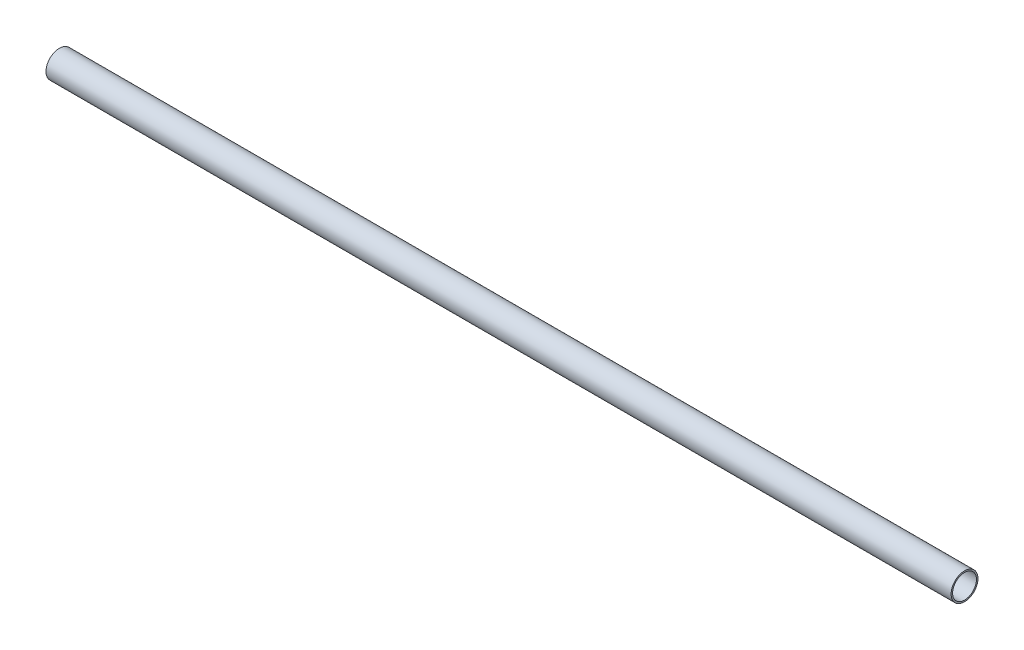
ISO-10303-21;
HEADER;
FILE_DESCRIPTION(('STEP AP214'),'2;1');
FILE_NAME('part.step','',(''),(''),'','','');
FILE_SCHEMA(('AUTOMOTIVE_DESIGN { 1 0 10303 214 1 1 1 1 }'));
ENDSEC;
DATA;
#1=APPLICATION_CONTEXT('core data for automotive mechanical design processes');
#2=APPLICATION_PROTOCOL_DEFINITION('international standard','automotive_design',2000,#1);
#3=PRODUCT_CONTEXT('',#1,'mechanical');
#4=PRODUCT('Part','Part','',(#3));
#5=PRODUCT_RELATED_PRODUCT_CATEGORY('part','',(#4));
#6=PRODUCT_DEFINITION_FORMATION('','',#4);
#7=PRODUCT_DEFINITION_CONTEXT('part definition',#1,'design');
#8=PRODUCT_DEFINITION('design','',#6,#7);
#9=PRODUCT_DEFINITION_SHAPE('','',#8);
#10=(LENGTH_UNIT() NAMED_UNIT(*) SI_UNIT(.MILLI.,.METRE.));
#11=(NAMED_UNIT(*) PLANE_ANGLE_UNIT() SI_UNIT($,.RADIAN.));
#12=(NAMED_UNIT(*) SI_UNIT($,.STERADIAN.) SOLID_ANGLE_UNIT());
#13=UNCERTAINTY_MEASURE_WITH_UNIT(LENGTH_MEASURE(1.E-05),#10,'distance_accuracy_value','');
#14=(GEOMETRIC_REPRESENTATION_CONTEXT(3) GLOBAL_UNCERTAINTY_ASSIGNED_CONTEXT((#13)) GLOBAL_UNIT_ASSIGNED_CONTEXT((#10,
#11,#12)) REPRESENTATION_CONTEXT('',''));
#15=CARTESIAN_POINT('',(0.,0.,0.));
#16=DIRECTION('',(0.,0.,1.));
#17=DIRECTION('',(1.,0.,0.));
#18=AXIS2_PLACEMENT_3D('',#15,#16,#17);
#19=CARTESIAN_POINT('',(-131.0386,0.,0.));
#20=DIRECTION('',(1.,0.,0.));
#21=DIRECTION('',(0.,0.,-1.));
#22=AXIS2_PLACEMENT_3D('',#19,#20,#21);
#23=CYLINDRICAL_SURFACE('',#22,3.175);
#24=CARTESIAN_POINT('',(-131.0386,0.,0.));
#25=DIRECTION('',(1.,0.,0.));
#26=DIRECTION('',(0.,0.,-1.));
#27=AXIS2_PLACEMENT_3D('',#24,#25,#26);
#28=CIRCLE('',#27,3.175);
#29=CARTESIAN_POINT('',(-131.0386,0.,-3.175));
#30=VERTEX_POINT('',#29);
#31=EDGE_CURVE('E11',#30,#30,#28,.T.);
#32=ORIENTED_EDGE('',*,*,#31,.T.);
#33=EDGE_LOOP('',(#32));
#34=FACE_BOUND('',#33,.T.);
#35=CARTESIAN_POINT('',(82.55,0.,0.));
#36=DIRECTION('',(1.,0.,0.));
#37=DIRECTION('',(0.,0.,-1.));
#38=AXIS2_PLACEMENT_3D('',#35,#36,#37);
#39=CIRCLE('',#38,3.175);
#40=CARTESIAN_POINT('',(82.55,0.,-3.175));
#41=VERTEX_POINT('',#40);
#42=EDGE_CURVE('E53',#41,#41,#39,.T.);
#43=ORIENTED_EDGE('',*,*,#42,.F.);
#44=EDGE_LOOP('',(#43));
#45=FACE_BOUND('',#44,.T.);
#46=ADVANCED_FACE('F43',(#34,#45),#23,.T.);
#47=CARTESIAN_POINT('',(-131.0386,0.,0.));
#48=DIRECTION('',(1.,0.,0.));
#49=DIRECTION('',(0.,0.,-1.));
#50=AXIS2_PLACEMENT_3D('',#47,#48,#49);
#51=PLANE('',#50);
#52=CARTESIAN_POINT('',(-131.0386,0.,0.));
#53=DIRECTION('',(1.,0.,0.));
#54=DIRECTION('',(0.,0.,-1.));
#55=AXIS2_PLACEMENT_3D('',#52,#53,#54);
#56=CIRCLE('',#55,2.8194);
#57=CARTESIAN_POINT('',(-131.0386,0.,-2.8194));
#58=VERTEX_POINT('',#57);
#59=EDGE_CURVE('E49',#58,#58,#56,.T.);
#60=ORIENTED_EDGE('',*,*,#59,.T.);
#61=EDGE_LOOP('',(#60));
#62=FACE_BOUND('',#61,.T.);
#63=ORIENTED_EDGE('',*,*,#31,.F.);
#64=EDGE_LOOP('',(#63));
#65=FACE_BOUND('',#64,.T.);
#66=ADVANCED_FACE('F72',(#62,#65),#51,.F.);
#67=CARTESIAN_POINT('',(-131.0386,0.,0.));
#68=DIRECTION('',(1.,0.,0.));
#69=DIRECTION('',(0.,0.,-1.));
#70=AXIS2_PLACEMENT_3D('',#67,#68,#69);
#71=CYLINDRICAL_SURFACE('',#70,2.8194);
#72=ORIENTED_EDGE('',*,*,#59,.F.);
#73=EDGE_LOOP('',(#72));
#74=FACE_BOUND('',#73,.T.);
#75=CARTESIAN_POINT('',(82.55,0.,0.));
#76=DIRECTION('',(1.,0.,0.));
#77=DIRECTION('',(0.,0.,-1.));
#78=AXIS2_PLACEMENT_3D('',#75,#76,#77);
#79=CIRCLE('',#78,2.8194);
#80=CARTESIAN_POINT('',(82.55,0.,-2.8194));
#81=VERTEX_POINT('',#80);
#82=EDGE_CURVE('E57',#81,#81,#79,.T.);
#83=ORIENTED_EDGE('',*,*,#82,.T.);
#84=EDGE_LOOP('',(#83));
#85=FACE_BOUND('',#84,.T.);
#86=ADVANCED_FACE('F63',(#74,#85),#71,.F.);
#87=CARTESIAN_POINT('',(82.55,0.,0.));
#88=DIRECTION('',(1.,0.,0.));
#89=DIRECTION('',(0.,0.,-1.));
#90=AXIS2_PLACEMENT_3D('',#87,#88,#89);
#91=PLANE('',#90);
#92=ORIENTED_EDGE('',*,*,#42,.T.);
#93=EDGE_LOOP('',(#92));
#94=FACE_BOUND('',#93,.T.);
#95=ORIENTED_EDGE('',*,*,#82,.F.);
#96=EDGE_LOOP('',(#95));
#97=FACE_BOUND('',#96,.T.);
#98=ADVANCED_FACE('F65',(#94,#97),#91,.T.);
#99=CLOSED_SHELL('',(#46,#66,#86,#98));
#100=MANIFOLD_SOLID_BREP('B2',#99);
#101=ADVANCED_BREP_SHAPE_REPRESENTATION('',(#18,#100),#14);
#102=SHAPE_DEFINITION_REPRESENTATION(#9,#101);
ENDSEC;
END-ISO-10303-21;
